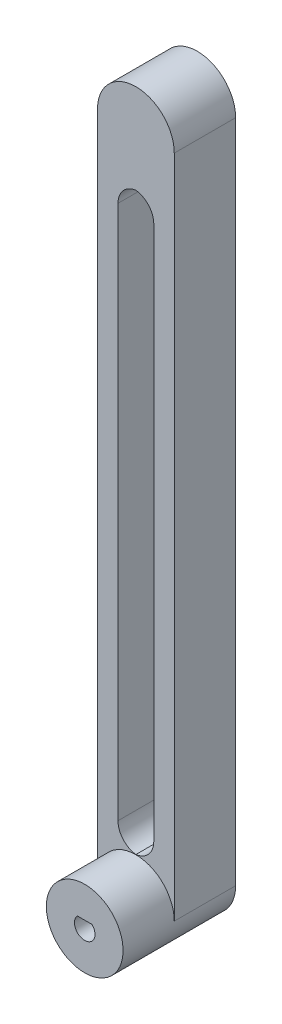
ISO-10303-21;
HEADER;
FILE_DESCRIPTION(('STEP AP214'),'2;1');
FILE_NAME('part.step','',(''),(''),'','','');
FILE_SCHEMA(('AUTOMOTIVE_DESIGN { 1 0 10303 214 1 1 1 1 }'));
ENDSEC;
DATA;
#1=APPLICATION_CONTEXT('core data for automotive mechanical design processes');
#2=APPLICATION_PROTOCOL_DEFINITION('international standard','automotive_design',2000,#1);
#3=PRODUCT_CONTEXT('',#1,'mechanical');
#4=PRODUCT('Part','Part','',(#3));
#5=PRODUCT_RELATED_PRODUCT_CATEGORY('part','',(#4));
#6=PRODUCT_DEFINITION_FORMATION('','',#4);
#7=PRODUCT_DEFINITION_CONTEXT('part definition',#1,'design');
#8=PRODUCT_DEFINITION('design','',#6,#7);
#9=PRODUCT_DEFINITION_SHAPE('','',#8);
#10=(LENGTH_UNIT() NAMED_UNIT(*) SI_UNIT(.MILLI.,.METRE.));
#11=(NAMED_UNIT(*) PLANE_ANGLE_UNIT() SI_UNIT($,.RADIAN.));
#12=(NAMED_UNIT(*) SI_UNIT($,.STERADIAN.) SOLID_ANGLE_UNIT());
#13=UNCERTAINTY_MEASURE_WITH_UNIT(LENGTH_MEASURE(1.E-05),#10,'distance_accuracy_value','');
#14=(GEOMETRIC_REPRESENTATION_CONTEXT(3) GLOBAL_UNCERTAINTY_ASSIGNED_CONTEXT((#13)) GLOBAL_UNIT_ASSIGNED_CONTEXT((#10,
#11,#12)) REPRESENTATION_CONTEXT('',''));
#15=CARTESIAN_POINT('',(0.,0.,0.));
#16=DIRECTION('',(0.,0.,1.));
#17=DIRECTION('',(1.,0.,0.));
#18=AXIS2_PLACEMENT_3D('',#15,#16,#17);
#19=CARTESIAN_POINT('',(1.85483870967741,102.58064516129,12.));
#20=DIRECTION('',(0.,0.,-1.));
#21=DIRECTION('',(-1.,0.,0.));
#22=AXIS2_PLACEMENT_3D('',#19,#20,#21);
#23=PLANE('',#22);
#24=DIRECTION('',(0.,1.,0.));
#25=VECTOR('',#24,1.);
#26=CARTESIAN_POINT('',(5.35483870967741,92.5806451612903,12.));
#27=LINE('',#26,#25);
#28=CARTESIAN_POINT('',(5.35483870967741,-15.9193548387097,12.));
#29=VERTEX_POINT('',#28);
#30=CARTESIAN_POINT('',(5.35483870967741,88.5806451612903,12.));
#31=VERTEX_POINT('',#30);
#32=EDGE_CURVE('E181',#29,#31,#27,.T.);
#33=ORIENTED_EDGE('',*,*,#32,.F.);
#34=CARTESIAN_POINT('',(1.35483870967741,-15.9193548387097,12.));
#35=DIRECTION('',(0.,0.,-1.));
#36=DIRECTION('',(-1.,0.,0.));
#37=AXIS2_PLACEMENT_3D('',#34,#35,#36);
#38=CIRCLE('',#37,4.);
#39=CARTESIAN_POINT('',(1.85483870967744,-19.8879818053066,12.));
#40=VERTEX_POINT('',#39);
#41=EDGE_CURVE('E298',#29,#40,#38,.T.);
#42=ORIENTED_EDGE('',*,*,#41,.T.);
#43=CARTESIAN_POINT('',(2.35483870967741,-15.9193548387097,12.));
#44=DIRECTION('',(0.,0.,-1.));
#45=DIRECTION('',(-1.,0.,0.));
#46=AXIS2_PLACEMENT_3D('',#43,#44,#45);
#47=CIRCLE('',#46,4.);
#48=CARTESIAN_POINT('',(-1.64516129032259,-15.9193548387097,12.));
#49=VERTEX_POINT('',#48);
#50=EDGE_CURVE('E292',#40,#49,#47,.T.);
#51=ORIENTED_EDGE('',*,*,#50,.T.);
#52=DIRECTION('',(0.,-1.,0.));
#53=VECTOR('',#52,1.);
#54=CARTESIAN_POINT('',(-1.64516129032259,92.5806451612903,12.));
#55=LINE('',#54,#53);
#56=CARTESIAN_POINT('',(-1.64516129032259,88.5806451612903,12.));
#57=VERTEX_POINT('',#56);
#58=EDGE_CURVE('E207',#57,#49,#55,.T.);
#59=ORIENTED_EDGE('',*,*,#58,.F.);
#60=CARTESIAN_POINT('',(2.35483870967741,88.5806451612903,12.));
#61=DIRECTION('',(0.,0.,-1.));
#62=DIRECTION('',(-1.,0.,0.));
#63=AXIS2_PLACEMENT_3D('',#60,#61,#62);
#64=CIRCLE('',#63,4.);
#65=CARTESIAN_POINT('',(1.85483870967741,92.5492721278872,12.));
#66=VERTEX_POINT('',#65);
#67=EDGE_CURVE('E309',#57,#66,#64,.T.);
#68=ORIENTED_EDGE('',*,*,#67,.T.);
#69=CARTESIAN_POINT('',(1.35483870967741,88.5806451612903,12.));
#70=DIRECTION('',(0.,0.,-1.));
#71=DIRECTION('',(-1.,0.,0.));
#72=AXIS2_PLACEMENT_3D('',#69,#70,#71);
#73=CIRCLE('',#72,4.);
#74=EDGE_CURVE('E304',#66,#31,#73,.T.);
#75=ORIENTED_EDGE('',*,*,#74,.T.);
#76=EDGE_LOOP('',(#33,#42,#51,#59,#68,#75));
#77=FACE_BOUND('',#76,.T.);
#78=CARTESIAN_POINT('',(1.85483870967743,-27.4193548387097,12.));
#79=DIRECTION('',(0.,0.,1.));
#80=DIRECTION('',(1.,0.,0.));
#81=AXIS2_PLACEMENT_3D('',#78,#79,#80);
#82=CIRCLE('',#81,7.50000000000001);
#83=CARTESIAN_POINT('',(9.35483870967743,-27.4193548387097,12.));
#84=VERTEX_POINT('',#83);
#85=CARTESIAN_POINT('',(-5.64516129032258,-27.4193548387097,12.));
#86=VERTEX_POINT('',#85);
#87=EDGE_CURVE('E155',#84,#86,#82,.T.);
#88=ORIENTED_EDGE('',*,*,#87,.F.);
#89=DIRECTION('',(0.,1.,0.));
#90=VECTOR('',#89,1.);
#91=CARTESIAN_POINT('',(9.35483870967741,102.58064516129,12.));
#92=LINE('',#91,#90);
#93=CARTESIAN_POINT('',(9.35483870967741,102.58064516129,12.));
#94=VERTEX_POINT('',#93);
#95=EDGE_CURVE('E248',#84,#94,#92,.T.);
#96=ORIENTED_EDGE('',*,*,#95,.T.);
#97=CARTESIAN_POINT('',(1.85483870967741,102.58064516129,12.));
#98=DIRECTION('',(0.,0.,1.));
#99=DIRECTION('',(-1.,0.,0.));
#100=AXIS2_PLACEMENT_3D('',#97,#98,#99);
#101=CIRCLE('',#100,7.5);
#102=CARTESIAN_POINT('',(-5.64516129032259,102.58064516129,12.));
#103=VERTEX_POINT('',#102);
#104=EDGE_CURVE('E240',#94,#103,#101,.T.);
#105=ORIENTED_EDGE('',*,*,#104,.T.);
#106=DIRECTION('',(0.,-1.,0.));
#107=VECTOR('',#106,1.);
#108=CARTESIAN_POINT('',(-5.64516129032259,102.58064516129,12.));
#109=LINE('',#108,#107);
#110=EDGE_CURVE('E244',#103,#86,#109,.T.);
#111=ORIENTED_EDGE('',*,*,#110,.T.);
#112=EDGE_LOOP('',(#88,#96,#105,#111));
#113=FACE_BOUND('',#112,.T.);
#114=ADVANCED_FACE('F47',(#77,#113),#23,.F.);
#115=CARTESIAN_POINT('',(1.85483870967741,102.58064516129,12.));
#116=DIRECTION('',(0.,0.,-1.));
#117=DIRECTION('',(-1.,0.,0.));
#118=AXIS2_PLACEMENT_3D('',#115,#116,#117);
#119=CYLINDRICAL_SURFACE('',#118,7.5);
#120=CARTESIAN_POINT('',(1.85483870967741,102.58064516129,0.));
#121=DIRECTION('',(0.,0.,1.));
#122=DIRECTION('',(-1.,0.,0.));
#123=AXIS2_PLACEMENT_3D('',#120,#121,#122);
#124=CIRCLE('',#123,7.5);
#125=CARTESIAN_POINT('',(9.35483870967741,102.58064516129,0.));
#126=VERTEX_POINT('',#125);
#127=CARTESIAN_POINT('',(-5.64516129032259,102.58064516129,0.));
#128=VERTEX_POINT('',#127);
#129=EDGE_CURVE('E239',#126,#128,#124,.T.);
#130=ORIENTED_EDGE('',*,*,#129,.T.);
#131=DIRECTION('',(0.,0.,-1.));
#132=VECTOR('',#131,1.);
#133=CARTESIAN_POINT('',(-5.64516129032259,102.58064516129,12.));
#134=LINE('',#133,#132);
#135=EDGE_CURVE('E274',#103,#128,#134,.T.);
#136=ORIENTED_EDGE('',*,*,#135,.F.);
#137=ORIENTED_EDGE('',*,*,#104,.F.);
#138=DIRECTION('',(0.,0.,-1.));
#139=VECTOR('',#138,1.);
#140=CARTESIAN_POINT('',(9.35483870967741,102.58064516129,12.));
#141=LINE('',#140,#139);
#142=EDGE_CURVE('E251',#94,#126,#141,.T.);
#143=ORIENTED_EDGE('',*,*,#142,.T.);
#144=EDGE_LOOP('',(#130,#136,#137,#143));
#145=FACE_BOUND('',#144,.T.);
#146=ADVANCED_FACE('F332',(#145),#119,.T.);
#147=CARTESIAN_POINT('',(-5.64516129032259,102.58064516129,12.));
#148=DIRECTION('',(1.,0.,0.));
#149=DIRECTION('',(0.,1.,0.));
#150=AXIS2_PLACEMENT_3D('',#147,#148,#149);
#151=PLANE('',#150);
#152=CARTESIAN_POINT('',(-5.64516129032259,78.768969581459,6.));
#153=DIRECTION('',(-1.,0.,0.));
#154=DIRECTION('',(0.,-1.,0.));
#155=AXIS2_PLACEMENT_3D('',#152,#153,#154);
#156=CIRCLE('',#155,5.15);
#157=CARTESIAN_POINT('',(-5.64516129032259,73.618969581459,6.));
#158=VERTEX_POINT('',#157);
#159=EDGE_CURVE('E182',#158,#158,#156,.T.);
#160=ORIENTED_EDGE('',*,*,#159,.F.);
#161=EDGE_LOOP('',(#160));
#162=FACE_BOUND('',#161,.T.);
#163=CARTESIAN_POINT('',(-5.64516129032258,53.768969581459,6.00000000000026));
#164=DIRECTION('',(-1.,0.,0.));
#165=DIRECTION('',(0.,-1.,0.));
#166=AXIS2_PLACEMENT_3D('',#163,#164,#165);
#167=CIRCLE('',#166,5.15);
#168=CARTESIAN_POINT('',(-5.64516129032258,48.618969581459,6.00000000000026));
#169=VERTEX_POINT('',#168);
#170=EDGE_CURVE('E186',#169,#169,#167,.T.);
#171=ORIENTED_EDGE('',*,*,#170,.F.);
#172=EDGE_LOOP('',(#171));
#173=FACE_BOUND('',#172,.T.);
#174=CARTESIAN_POINT('',(-5.64516129032258,28.768969581459,6.00000000000052));
#175=DIRECTION('',(-1.,0.,0.));
#176=DIRECTION('',(0.,-1.,0.));
#177=AXIS2_PLACEMENT_3D('',#174,#175,#176);
#178=CIRCLE('',#177,5.15);
#179=CARTESIAN_POINT('',(-5.64516129032258,23.618969581459,6.00000000000052));
#180=VERTEX_POINT('',#179);
#181=EDGE_CURVE('E194',#180,#180,#178,.T.);
#182=ORIENTED_EDGE('',*,*,#181,.F.);
#183=EDGE_LOOP('',(#182));
#184=FACE_BOUND('',#183,.T.);
#185=DIRECTION('',(0.,-1.,0.));
#186=VECTOR('',#185,1.);
#187=CARTESIAN_POINT('',(-5.64516129032259,102.58064516129,0.));
#188=LINE('',#187,#186);
#189=CARTESIAN_POINT('',(-5.64516129032258,-27.4193548387097,0.));
#190=VERTEX_POINT('',#189);
#191=EDGE_CURVE('E255',#128,#190,#188,.T.);
#192=ORIENTED_EDGE('',*,*,#191,.T.);
#193=DIRECTION('',(0.,0.,-1.));
#194=VECTOR('',#193,1.);
#195=CARTESIAN_POINT('',(-5.64516129032258,-27.4193548387097,12.));
#196=LINE('',#195,#194);
#197=EDGE_CURVE('E270',#86,#190,#196,.T.);
#198=ORIENTED_EDGE('',*,*,#197,.F.);
#199=ORIENTED_EDGE('',*,*,#110,.F.);
#200=ORIENTED_EDGE('',*,*,#135,.T.);
#201=EDGE_LOOP('',(#192,#198,#199,#200));
#202=FACE_BOUND('',#201,.T.);
#203=ADVANCED_FACE('F340',(#162,#173,#184,#202),#151,.F.);
#204=CARTESIAN_POINT('',(1.85483870967743,-27.4193548387097,12.));
#205=DIRECTION('',(0.,0.,-1.));
#206=DIRECTION('',(-1.,0.,0.));
#207=AXIS2_PLACEMENT_3D('',#204,#205,#206);
#208=CYLINDRICAL_SURFACE('',#207,7.5);
#209=CARTESIAN_POINT('',(1.85483870967743,-27.4193548387097,0.));
#210=DIRECTION('',(0.,0.,1.));
#211=DIRECTION('',(1.,0.,0.));
#212=AXIS2_PLACEMENT_3D('',#209,#210,#211);
#213=CIRCLE('',#212,7.5);
#214=CARTESIAN_POINT('',(9.35483870967743,-27.4193548387097,0.));
#215=VERTEX_POINT('',#214);
#216=EDGE_CURVE('E258',#190,#215,#213,.T.);
#217=ORIENTED_EDGE('',*,*,#216,.T.);
#218=DIRECTION('',(0.,0.,-1.));
#219=VECTOR('',#218,1.);
#220=CARTESIAN_POINT('',(9.35483870967743,-27.4193548387097,12.));
#221=LINE('',#220,#219);
#222=EDGE_CURVE('E266',#84,#215,#221,.T.);
#223=ORIENTED_EDGE('',*,*,#222,.F.);
#224=ORIENTED_EDGE('',*,*,#87,.T.);
#225=ORIENTED_EDGE('',*,*,#197,.T.);
#226=EDGE_LOOP('',(#217,#223,#224,#225));
#227=FACE_BOUND('',#226,.T.);
#228=CARTESIAN_POINT('',(1.85483870967743,-27.4193548387097,22.));
#229=DIRECTION('',(0.,0.,1.));
#230=DIRECTION('',(-1.,0.,0.));
#231=AXIS2_PLACEMENT_3D('',#228,#229,#230);
#232=CIRCLE('',#231,7.50000000000001);
#233=CARTESIAN_POINT('',(-5.64516129032258,-27.4193548387097,22.));
#234=VERTEX_POINT('',#233);
#235=EDGE_CURVE('E169',#234,#234,#232,.T.);
#236=ORIENTED_EDGE('',*,*,#235,.F.);
#237=EDGE_LOOP('',(#236));
#238=FACE_BOUND('',#237,.T.);
#239=ADVANCED_FACE('F355',(#227,#238),#208,.T.);
#240=CARTESIAN_POINT('',(9.35483870967741,102.58064516129,12.));
#241=DIRECTION('',(-1.,0.,0.));
#242=DIRECTION('',(0.,-1.,0.));
#243=AXIS2_PLACEMENT_3D('',#240,#241,#242);
#244=PLANE('',#243);
#245=DIRECTION('',(0.,1.,0.));
#246=VECTOR('',#245,1.);
#247=CARTESIAN_POINT('',(9.35483870967741,102.58064516129,0.));
#248=LINE('',#247,#246);
#249=EDGE_CURVE('E245',#215,#126,#248,.T.);
#250=ORIENTED_EDGE('',*,*,#249,.T.);
#251=ORIENTED_EDGE('',*,*,#142,.F.);
#252=ORIENTED_EDGE('',*,*,#95,.F.);
#253=ORIENTED_EDGE('',*,*,#222,.T.);
#254=EDGE_LOOP('',(#250,#251,#252,#253));
#255=FACE_BOUND('',#254,.T.);
#256=ADVANCED_FACE('F352',(#255),#244,.F.);
#257=CARTESIAN_POINT('',(1.85483870967741,102.58064516129,0.));
#258=DIRECTION('',(0.,0.,-1.));
#259=DIRECTION('',(-1.,0.,0.));
#260=AXIS2_PLACEMENT_3D('',#257,#258,#259);
#261=PLANE('',#260);
#262=CARTESIAN_POINT('',(2.35483870967741,-15.9193548387097,0.));
#263=DIRECTION('',(0.,0.,-1.));
#264=DIRECTION('',(-1.,0.,0.));
#265=AXIS2_PLACEMENT_3D('',#262,#263,#264);
#266=CIRCLE('',#265,4.);
#267=CARTESIAN_POINT('',(-1.64516129032259,-15.9193548387097,0.));
#268=VERTEX_POINT('',#267);
#269=CARTESIAN_POINT('',(1.85483870967744,-19.8879818053066,0.));
#270=VERTEX_POINT('',#269);
#271=EDGE_CURVE('E295',#268,#270,#266,.F.);
#272=ORIENTED_EDGE('',*,*,#271,.T.);
#273=CARTESIAN_POINT('',(1.35483870967741,-15.9193548387097,0.));
#274=DIRECTION('',(0.,0.,-1.));
#275=DIRECTION('',(-1.,0.,0.));
#276=AXIS2_PLACEMENT_3D('',#273,#274,#275);
#277=CIRCLE('',#276,4.);
#278=CARTESIAN_POINT('',(5.35483870967741,-15.9193548387097,0.));
#279=VERTEX_POINT('',#278);
#280=EDGE_CURVE('E301',#270,#279,#277,.F.);
#281=ORIENTED_EDGE('',*,*,#280,.T.);
#282=DIRECTION('',(0.,1.,0.));
#283=VECTOR('',#282,1.);
#284=CARTESIAN_POINT('',(5.35483870967741,92.5806451612903,0.));
#285=LINE('',#284,#283);
#286=CARTESIAN_POINT('',(5.35483870967741,88.5806451612903,0.));
#287=VERTEX_POINT('',#286);
#288=EDGE_CURVE('E203',#279,#287,#285,.T.);
#289=ORIENTED_EDGE('',*,*,#288,.T.);
#290=CARTESIAN_POINT('',(1.35483870967741,88.5806451612903,0.));
#291=DIRECTION('',(0.,0.,-1.));
#292=DIRECTION('',(-1.,0.,0.));
#293=AXIS2_PLACEMENT_3D('',#290,#291,#292);
#294=CIRCLE('',#293,4.);
#295=CARTESIAN_POINT('',(1.85483870967741,92.5492721278872,0.));
#296=VERTEX_POINT('',#295);
#297=EDGE_CURVE('E71',#287,#296,#294,.F.);
#298=ORIENTED_EDGE('',*,*,#297,.T.);
#299=CARTESIAN_POINT('',(2.35483870967741,88.5806451612903,0.));
#300=DIRECTION('',(0.,0.,-1.));
#301=DIRECTION('',(-1.,0.,0.));
#302=AXIS2_PLACEMENT_3D('',#299,#300,#301);
#303=CIRCLE('',#302,4.);
#304=CARTESIAN_POINT('',(-1.64516129032259,88.5806451612903,0.));
#305=VERTEX_POINT('',#304);
#306=EDGE_CURVE('E312',#296,#305,#303,.F.);
#307=ORIENTED_EDGE('',*,*,#306,.T.);
#308=DIRECTION('',(0.,-1.,0.));
#309=VECTOR('',#308,1.);
#310=CARTESIAN_POINT('',(-1.64516129032259,92.5806451612903,0.));
#311=LINE('',#310,#309);
#312=EDGE_CURVE('E206',#305,#268,#311,.T.);
#313=ORIENTED_EDGE('',*,*,#312,.T.);
#314=EDGE_LOOP('',(#272,#281,#289,#298,#307,#313));
#315=FACE_BOUND('',#314,.T.);
#316=CARTESIAN_POINT('',(1.85483870967743,-27.4193548387097,0.));
#317=DIRECTION('',(0.,0.,-1.));
#318=DIRECTION('',(-1.,0.,0.));
#319=AXIS2_PLACEMENT_3D('',#316,#317,#318);
#320=CIRCLE('',#319,3.1);
#321=CARTESIAN_POINT('',(3.54303301129084,-24.8193548387097,0.));
#322=VERTEX_POINT('',#321);
#323=CARTESIAN_POINT('',(0.166644408064011,-24.8193548387097,0.));
#324=VERTEX_POINT('',#323);
#325=EDGE_CURVE('E231',#322,#324,#320,.T.);
#326=ORIENTED_EDGE('',*,*,#325,.F.);
#327=DIRECTION('',(1.,0.,0.));
#328=VECTOR('',#327,1.);
#329=CARTESIAN_POINT('',(1.85483870967741,-24.8193548387097,0.));
#330=LINE('',#329,#328);
#331=EDGE_CURVE('E226',#324,#322,#330,.T.);
#332=ORIENTED_EDGE('',*,*,#331,.F.);
#333=EDGE_LOOP('',(#326,#332));
#334=FACE_BOUND('',#333,.T.);
#335=ORIENTED_EDGE('',*,*,#129,.F.);
#336=ORIENTED_EDGE('',*,*,#249,.F.);
#337=ORIENTED_EDGE('',*,*,#216,.F.);
#338=ORIENTED_EDGE('',*,*,#191,.F.);
#339=EDGE_LOOP('',(#335,#336,#337,#338));
#340=FACE_BOUND('',#339,.T.);
#341=ADVANCED_FACE('F349',(#315,#334,#340),#261,.T.);
#342=CARTESIAN_POINT('',(1.85483870967743,-27.4193548387097,-23.));
#343=DIRECTION('',(0.,0.,1.));
#344=DIRECTION('',(1.,0.,0.));
#345=AXIS2_PLACEMENT_3D('',#342,#343,#344);
#346=CYLINDRICAL_SURFACE('',#345,3.1);
#347=DIRECTION('',(0.,0.,1.));
#348=VECTOR('',#347,1.);
#349=CARTESIAN_POINT('',(3.54303301129084,-24.8193548387097,-23.));
#350=LINE('',#349,#348);
#351=CARTESIAN_POINT('',(3.54303301129084,-24.8193548387097,12.));
#352=VERTEX_POINT('',#351);
#353=EDGE_CURVE('E221',#322,#352,#350,.T.);
#354=ORIENTED_EDGE('',*,*,#353,.F.);
#355=ORIENTED_EDGE('',*,*,#325,.T.);
#356=DIRECTION('',(0.,0.,1.));
#357=VECTOR('',#356,1.);
#358=CARTESIAN_POINT('',(0.166644408064011,-24.8193548387097,-23.));
#359=LINE('',#358,#357);
#360=CARTESIAN_POINT('',(0.166644408064011,-24.8193548387097,12.));
#361=VERTEX_POINT('',#360);
#362=EDGE_CURVE('E222',#324,#361,#359,.T.);
#363=ORIENTED_EDGE('',*,*,#362,.T.);
#364=CARTESIAN_POINT('',(1.85483870967743,-27.4193548387097,12.));
#365=DIRECTION('',(0.,0.,-1.));
#366=DIRECTION('',(-1.,0.,0.));
#367=AXIS2_PLACEMENT_3D('',#364,#365,#366);
#368=CIRCLE('',#367,3.1);
#369=EDGE_CURVE('E235',#352,#361,#368,.T.);
#370=ORIENTED_EDGE('',*,*,#369,.F.);
#371=EDGE_LOOP('',(#354,#355,#363,#370));
#372=FACE_BOUND('',#371,.T.);
#373=ADVANCED_FACE('F347',(#372),#346,.F.);
#374=CARTESIAN_POINT('',(0.166644408064011,-24.8193548387097,-23.));
#375=DIRECTION('',(0.,1.,0.));
#376=DIRECTION('',(0.,0.,1.));
#377=AXIS2_PLACEMENT_3D('',#374,#375,#376);
#378=PLANE('',#377);
#379=ORIENTED_EDGE('',*,*,#353,.T.);
#380=DIRECTION('',(1.,0.,0.));
#381=VECTOR('',#380,1.);
#382=CARTESIAN_POINT('',(0.166644408064011,-24.8193548387097,12.));
#383=LINE('',#382,#381);
#384=EDGE_CURVE('E211',#361,#352,#383,.T.);
#385=ORIENTED_EDGE('',*,*,#384,.F.);
#386=ORIENTED_EDGE('',*,*,#362,.F.);
#387=ORIENTED_EDGE('',*,*,#331,.T.);
#388=EDGE_LOOP('',(#379,#385,#386,#387));
#389=FACE_BOUND('',#388,.T.);
#390=ADVANCED_FACE('F399',(#389),#378,.F.);
#391=CARTESIAN_POINT('',(-1.64516129032259,92.5806451612903,0.));
#392=DIRECTION('',(-1.,0.,0.));
#393=DIRECTION('',(0.,-1.,0.));
#394=AXIS2_PLACEMENT_3D('',#391,#392,#393);
#395=PLANE('',#394);
#396=ORIENTED_EDGE('',*,*,#58,.T.);
#397=DIRECTION('',(0.,0.,1.));
#398=VECTOR('',#397,1.);
#399=CARTESIAN_POINT('',(-1.64516129032259,-15.9193548387097,0.));
#400=LINE('',#399,#398);
#401=EDGE_CURVE('E281',#49,#268,#400,.F.);
#402=ORIENTED_EDGE('',*,*,#401,.T.);
#403=ORIENTED_EDGE('',*,*,#312,.F.);
#404=DIRECTION('',(0.,0.,1.));
#405=VECTOR('',#404,1.);
#406=CARTESIAN_POINT('',(-1.64516129032259,88.5806451612903,12.));
#407=LINE('',#406,#405);
#408=EDGE_CURVE('E278',#305,#57,#407,.T.);
#409=ORIENTED_EDGE('',*,*,#408,.T.);
#410=EDGE_LOOP('',(#396,#402,#403,#409));
#411=FACE_BOUND('',#410,.T.);
#412=ADVANCED_FACE('F395',(#411),#395,.F.);
#413=CARTESIAN_POINT('',(5.35483870967741,92.5806451612903,0.));
#414=DIRECTION('',(1.,0.,0.));
#415=DIRECTION('',(0.,0.,-1.));
#416=AXIS2_PLACEMENT_3D('',#413,#414,#415);
#417=PLANE('',#416);
#418=ORIENTED_EDGE('',*,*,#288,.F.);
#419=DIRECTION('',(0.,0.,1.));
#420=VECTOR('',#419,1.);
#421=CARTESIAN_POINT('',(5.35483870967741,-15.9193548387097,12.));
#422=LINE('',#421,#420);
#423=EDGE_CURVE('E289',#279,#29,#422,.T.);
#424=ORIENTED_EDGE('',*,*,#423,.T.);
#425=ORIENTED_EDGE('',*,*,#32,.T.);
#426=DIRECTION('',(0.,0.,1.));
#427=VECTOR('',#426,1.);
#428=CARTESIAN_POINT('',(5.35483870967741,88.5806451612903,0.));
#429=LINE('',#428,#427);
#430=EDGE_CURVE('E285',#31,#287,#429,.F.);
#431=ORIENTED_EDGE('',*,*,#430,.T.);
#432=EDGE_LOOP('',(#418,#424,#425,#431));
#433=FACE_BOUND('',#432,.T.);
#434=ADVANCED_FACE('F384',(#433),#417,.F.);
#435=CARTESIAN_POINT('',(-3.64516129032258,28.768969581459,6.00000000000052));
#436=DIRECTION('',(-1.,0.,0.));
#437=DIRECTION('',(0.,-1.,0.));
#438=AXIS2_PLACEMENT_3D('',#435,#436,#437);
#439=CYLINDRICAL_SURFACE('',#438,5.15);
#440=CARTESIAN_POINT('',(-3.64516129032258,28.768969581459,6.00000000000052));
#441=DIRECTION('',(-1.,0.,0.));
#442=DIRECTION('',(0.,-1.,0.));
#443=AXIS2_PLACEMENT_3D('',#440,#441,#442);
#444=CIRCLE('',#443,5.15);
#445=CARTESIAN_POINT('',(-3.64516129032258,23.618969581459,6.00000000000052));
#446=VERTEX_POINT('',#445);
#447=EDGE_CURVE('E198',#446,#446,#444,.T.);
#448=ORIENTED_EDGE('',*,*,#447,.F.);
#449=EDGE_LOOP('',(#448));
#450=FACE_BOUND('',#449,.T.);
#451=ORIENTED_EDGE('',*,*,#181,.T.);
#452=EDGE_LOOP('',(#451));
#453=FACE_BOUND('',#452,.T.);
#454=ADVANCED_FACE('F404',(#450,#453),#439,.F.);
#455=CARTESIAN_POINT('',(-3.64516129032258,28.768969581459,6.00000000000052));
#456=DIRECTION('',(-1.,0.,0.));
#457=DIRECTION('',(0.,-1.,0.));
#458=AXIS2_PLACEMENT_3D('',#455,#456,#457);
#459=PLANE('',#458);
#460=ORIENTED_EDGE('',*,*,#447,.T.);
#461=EDGE_LOOP('',(#460));
#462=FACE_BOUND('',#461,.T.);
#463=ADVANCED_FACE('F409',(#462),#459,.T.);
#464=CARTESIAN_POINT('',(-3.64516129032258,53.768969581459,6.00000000000026));
#465=DIRECTION('',(-1.,0.,0.));
#466=DIRECTION('',(0.,-1.,0.));
#467=AXIS2_PLACEMENT_3D('',#464,#465,#466);
#468=CYLINDRICAL_SURFACE('',#467,5.15);
#469=CARTESIAN_POINT('',(-3.64516129032258,53.768969581459,6.00000000000026));
#470=DIRECTION('',(-1.,0.,0.));
#471=DIRECTION('',(0.,-1.,0.));
#472=AXIS2_PLACEMENT_3D('',#469,#470,#471);
#473=CIRCLE('',#472,5.15);
#474=CARTESIAN_POINT('',(-3.64516129032258,48.618969581459,6.00000000000026));
#475=VERTEX_POINT('',#474);
#476=EDGE_CURVE('E190',#475,#475,#473,.T.);
#477=ORIENTED_EDGE('',*,*,#476,.F.);
#478=EDGE_LOOP('',(#477));
#479=FACE_BOUND('',#478,.T.);
#480=ORIENTED_EDGE('',*,*,#170,.T.);
#481=EDGE_LOOP('',(#480));
#482=FACE_BOUND('',#481,.T.);
#483=ADVANCED_FACE('F412',(#479,#482),#468,.F.);
#484=CARTESIAN_POINT('',(-3.64516129032258,53.768969581459,6.00000000000026));
#485=DIRECTION('',(-1.,0.,0.));
#486=DIRECTION('',(0.,-1.,0.));
#487=AXIS2_PLACEMENT_3D('',#484,#485,#486);
#488=PLANE('',#487);
#489=ORIENTED_EDGE('',*,*,#476,.T.);
#490=EDGE_LOOP('',(#489));
#491=FACE_BOUND('',#490,.T.);
#492=ADVANCED_FACE('F417',(#491),#488,.T.);
#493=CARTESIAN_POINT('',(-3.64516129032259,78.768969581459,6.));
#494=DIRECTION('',(-1.,0.,0.));
#495=DIRECTION('',(0.,-1.,0.));
#496=AXIS2_PLACEMENT_3D('',#493,#494,#495);
#497=CYLINDRICAL_SURFACE('',#496,5.15);
#498=CARTESIAN_POINT('',(-3.64516129032259,78.768969581459,6.));
#499=DIRECTION('',(-1.,0.,0.));
#500=DIRECTION('',(0.,-1.,0.));
#501=AXIS2_PLACEMENT_3D('',#498,#499,#500);
#502=CIRCLE('',#501,5.15);
#503=CARTESIAN_POINT('',(-3.64516129032259,73.618969581459,6.));
#504=VERTEX_POINT('',#503);
#505=EDGE_CURVE('E177',#504,#504,#502,.T.);
#506=ORIENTED_EDGE('',*,*,#505,.F.);
#507=EDGE_LOOP('',(#506));
#508=FACE_BOUND('',#507,.T.);
#509=ORIENTED_EDGE('',*,*,#159,.T.);
#510=EDGE_LOOP('',(#509));
#511=FACE_BOUND('',#510,.T.);
#512=ADVANCED_FACE('F420',(#508,#511),#497,.F.);
#513=CARTESIAN_POINT('',(-3.64516129032259,78.768969581459,6.));
#514=DIRECTION('',(-1.,0.,0.));
#515=DIRECTION('',(0.,-1.,0.));
#516=AXIS2_PLACEMENT_3D('',#513,#514,#515);
#517=PLANE('',#516);
#518=ORIENTED_EDGE('',*,*,#505,.T.);
#519=EDGE_LOOP('',(#518));
#520=FACE_BOUND('',#519,.T.);
#521=ADVANCED_FACE('F368',(#520),#517,.T.);
#522=CARTESIAN_POINT('',(1.35483870967741,-15.9193548387097,0.));
#523=DIRECTION('',(0.,0.,-1.));
#524=DIRECTION('',(-1.,0.,0.));
#525=AXIS2_PLACEMENT_3D('',#522,#523,#524);
#526=CYLINDRICAL_SURFACE('',#525,4.);
#527=ORIENTED_EDGE('',*,*,#423,.F.);
#528=ORIENTED_EDGE('',*,*,#280,.F.);
#529=DIRECTION('',(0.,0.,-1.));
#530=VECTOR('',#529,1.);
#531=CARTESIAN_POINT('',(1.85483870967744,-19.8879818053066,6.));
#532=LINE('',#531,#530);
#533=EDGE_CURVE('E202',#40,#270,#532,.T.);
#534=ORIENTED_EDGE('',*,*,#533,.F.);
#535=ORIENTED_EDGE('',*,*,#41,.F.);
#536=EDGE_LOOP('',(#527,#528,#534,#535));
#537=FACE_BOUND('',#536,.T.);
#538=ADVANCED_FACE('F365',(#537),#526,.F.);
#539=CARTESIAN_POINT('',(2.35483870967741,-15.9193548387097,0.));
#540=DIRECTION('',(0.,0.,-1.));
#541=DIRECTION('',(-1.,0.,0.));
#542=AXIS2_PLACEMENT_3D('',#539,#540,#541);
#543=CYLINDRICAL_SURFACE('',#542,4.);
#544=ORIENTED_EDGE('',*,*,#271,.F.);
#545=ORIENTED_EDGE('',*,*,#401,.F.);
#546=ORIENTED_EDGE('',*,*,#50,.F.);
#547=ORIENTED_EDGE('',*,*,#533,.T.);
#548=EDGE_LOOP('',(#544,#545,#546,#547));
#549=FACE_BOUND('',#548,.T.);
#550=ADVANCED_FACE('F362',(#549),#543,.F.);
#551=CARTESIAN_POINT('',(2.35483870967741,88.5806451612903,0.));
#552=DIRECTION('',(0.,0.,-1.));
#553=DIRECTION('',(-1.,0.,0.));
#554=AXIS2_PLACEMENT_3D('',#551,#552,#553);
#555=CYLINDRICAL_SURFACE('',#554,4.);
#556=ORIENTED_EDGE('',*,*,#408,.F.);
#557=ORIENTED_EDGE('',*,*,#306,.F.);
#558=DIRECTION('',(0.,0.,-1.));
#559=VECTOR('',#558,1.);
#560=CARTESIAN_POINT('',(1.85483870967741,92.5492721278872,6.));
#561=LINE('',#560,#559);
#562=EDGE_CURVE('E173',#66,#296,#561,.T.);
#563=ORIENTED_EDGE('',*,*,#562,.F.);
#564=ORIENTED_EDGE('',*,*,#67,.F.);
#565=EDGE_LOOP('',(#556,#557,#563,#564));
#566=FACE_BOUND('',#565,.T.);
#567=ADVANCED_FACE('F49',(#566),#555,.F.);
#568=CARTESIAN_POINT('',(1.35483870967741,88.5806451612903,0.));
#569=DIRECTION('',(0.,0.,-1.));
#570=DIRECTION('',(-1.,0.,0.));
#571=AXIS2_PLACEMENT_3D('',#568,#569,#570);
#572=CYLINDRICAL_SURFACE('',#571,4.);
#573=ORIENTED_EDGE('',*,*,#297,.F.);
#574=ORIENTED_EDGE('',*,*,#430,.F.);
#575=ORIENTED_EDGE('',*,*,#74,.F.);
#576=ORIENTED_EDGE('',*,*,#562,.T.);
#577=EDGE_LOOP('',(#573,#574,#575,#576));
#578=FACE_BOUND('',#577,.T.);
#579=ADVANCED_FACE('F370',(#578),#572,.F.);
#580=CARTESIAN_POINT('',(1.85483870967743,-27.4193548387097,22.));
#581=DIRECTION('',(0.,0.,-1.));
#582=DIRECTION('',(-1.,0.,0.));
#583=AXIS2_PLACEMENT_3D('',#580,#581,#582);
#584=PLANE('',#583);
#585=ORIENTED_EDGE('',*,*,#235,.T.);
#586=EDGE_LOOP('',(#585));
#587=FACE_BOUND('',#586,.T.);
#588=CARTESIAN_POINT('',(1.85483870967743,-27.4193548387097,22.));
#589=DIRECTION('',(0.,0.,1.));
#590=DIRECTION('',(1.,0.,0.));
#591=AXIS2_PLACEMENT_3D('',#588,#589,#590);
#592=CIRCLE('',#591,2.01);
#593=CARTESIAN_POINT('',(0.42833643854276,-26.0033070745267,22.));
#594=VERTEX_POINT('',#593);
#595=CARTESIAN_POINT('',(3.28134098081209,-26.0033070745267,22.));
#596=VERTEX_POINT('',#595);
#597=EDGE_CURVE('E151',#594,#596,#592,.T.);
#598=ORIENTED_EDGE('',*,*,#597,.F.);
#599=DIRECTION('',(-1.,0.,0.));
#600=VECTOR('',#599,1.);
#601=CARTESIAN_POINT('',(3.28134098081209,-26.0033070745267,22.));
#602=LINE('',#601,#600);
#603=EDGE_CURVE('E158',#596,#594,#602,.T.);
#604=ORIENTED_EDGE('',*,*,#603,.F.);
#605=EDGE_LOOP('',(#598,#604));
#606=FACE_BOUND('',#605,.T.);
#607=ADVANCED_FACE('F163',(#587,#606),#584,.F.);
#608=CARTESIAN_POINT('',(1.85483870967743,-27.4193548387097,12.));
#609=DIRECTION('',(0.,0.,-1.));
#610=DIRECTION('',(-1.,0.,0.));
#611=AXIS2_PLACEMENT_3D('',#608,#609,#610);
#612=PLANE('',#611);
#613=ORIENTED_EDGE('',*,*,#384,.T.);
#614=ORIENTED_EDGE('',*,*,#369,.T.);
#615=EDGE_LOOP('',(#613,#614));
#616=FACE_BOUND('',#615,.T.);
#617=ADVANCED_FACE('F376',(#616),#612,.T.);
#618=CARTESIAN_POINT('',(1.85483870967743,-27.4193548387097,12.));
#619=DIRECTION('',(0.,0.,1.));
#620=DIRECTION('',(1.,0.,0.));
#621=AXIS2_PLACEMENT_3D('',#618,#619,#620);
#622=CYLINDRICAL_SURFACE('',#621,2.01);
#623=CARTESIAN_POINT('',(1.85483870967743,-27.4193548387097,15.));
#624=DIRECTION('',(0.,0.,1.));
#625=DIRECTION('',(1.,0.,0.));
#626=AXIS2_PLACEMENT_3D('',#623,#624,#625);
#627=CIRCLE('',#626,2.01);
#628=CARTESIAN_POINT('',(0.42833643854276,-26.0033070745267,15.));
#629=VERTEX_POINT('',#628);
#630=CARTESIAN_POINT('',(3.28134098081209,-26.0033070745267,15.));
#631=VERTEX_POINT('',#630);
#632=EDGE_CURVE('E11',#629,#631,#627,.T.);
#633=ORIENTED_EDGE('',*,*,#632,.F.);
#634=DIRECTION('',(0.,0.,1.));
#635=VECTOR('',#634,1.);
#636=CARTESIAN_POINT('',(0.42833643854276,-26.0033070745267,12.));
#637=LINE('',#636,#635);
#638=EDGE_CURVE('E63',#629,#594,#637,.T.);
#639=ORIENTED_EDGE('',*,*,#638,.T.);
#640=ORIENTED_EDGE('',*,*,#597,.T.);
#641=DIRECTION('',(0.,0.,1.));
#642=VECTOR('',#641,1.);
#643=CARTESIAN_POINT('',(3.28134098081209,-26.0033070745267,12.));
#644=LINE('',#643,#642);
#645=EDGE_CURVE('E156',#631,#596,#644,.T.);
#646=ORIENTED_EDGE('',*,*,#645,.F.);
#647=EDGE_LOOP('',(#633,#639,#640,#646));
#648=FACE_BOUND('',#647,.T.);
#649=ADVANCED_FACE('F148',(#648),#622,.F.);
#650=CARTESIAN_POINT('',(3.28134098081209,-26.0033070745267,12.));
#651=DIRECTION('',(0.,1.,0.));
#652=DIRECTION('',(0.,0.,1.));
#653=AXIS2_PLACEMENT_3D('',#650,#651,#652);
#654=PLANE('',#653);
#655=DIRECTION('',(-1.,0.,0.));
#656=VECTOR('',#655,1.);
#657=CARTESIAN_POINT('',(1.85483870967743,-26.0033070745267,15.));
#658=LINE('',#657,#656);
#659=EDGE_CURVE('E56',#631,#629,#658,.T.);
#660=ORIENTED_EDGE('',*,*,#659,.F.);
#661=ORIENTED_EDGE('',*,*,#645,.T.);
#662=ORIENTED_EDGE('',*,*,#603,.T.);
#663=ORIENTED_EDGE('',*,*,#638,.F.);
#664=EDGE_LOOP('',(#660,#661,#662,#663));
#665=FACE_BOUND('',#664,.T.);
#666=ADVANCED_FACE('F159',(#665),#654,.F.);
#667=CARTESIAN_POINT('',(1.85483870967743,-27.4193548387097,15.));
#668=DIRECTION('',(0.,0.,1.));
#669=DIRECTION('',(1.,0.,0.));
#670=AXIS2_PLACEMENT_3D('',#667,#668,#669);
#671=PLANE('',#670);
#672=ORIENTED_EDGE('',*,*,#659,.T.);
#673=ORIENTED_EDGE('',*,*,#632,.T.);
#674=EDGE_LOOP('',(#672,#673));
#675=FACE_BOUND('',#674,.T.);
#676=ADVANCED_FACE('F322',(#675),#671,.T.);
#677=CLOSED_SHELL('',(#114,#146,#203,#239,#256,#341,#373,#390,#412,#434,#454,#463,#483,#492,
#512,#521,#538,#550,#567,#579,#607,#617,#649,#666,#676));
#678=MANIFOLD_SOLID_BREP('B2',#677);
#679=ADVANCED_BREP_SHAPE_REPRESENTATION('',(#18,#678),#14);
#680=SHAPE_DEFINITION_REPRESENTATION(#9,#679);
ENDSEC;
END-ISO-10303-21;
